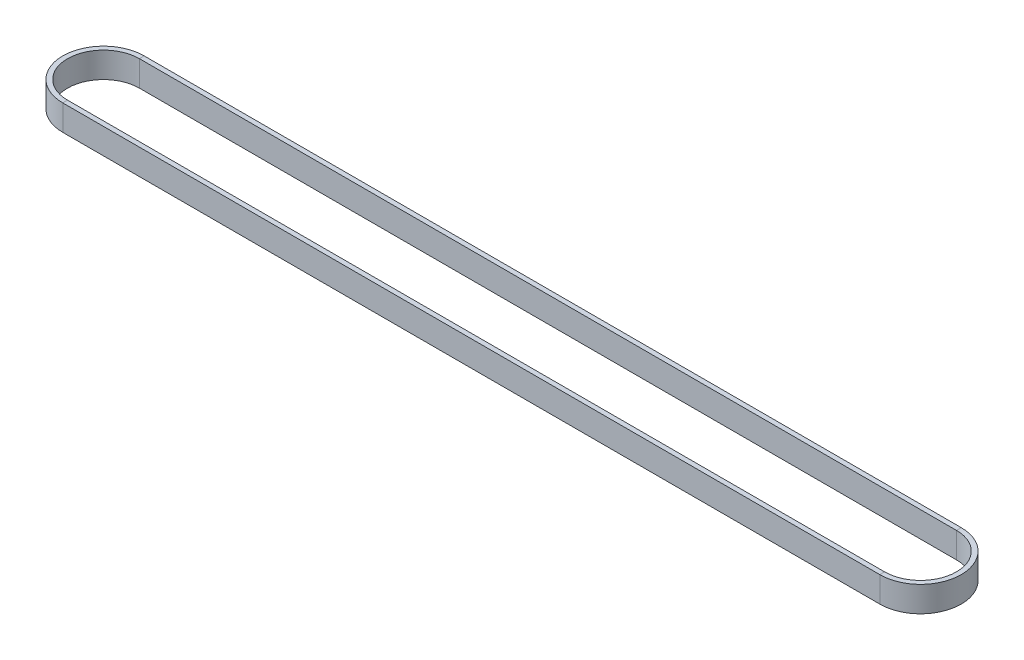
ISO-10303-21;
HEADER;
FILE_DESCRIPTION(('STEP AP214'),'2;1');
FILE_NAME('part.step','',(''),(''),'','','');
FILE_SCHEMA(('AUTOMOTIVE_DESIGN { 1 0 10303 214 1 1 1 1 }'));
ENDSEC;
DATA;
#1=APPLICATION_CONTEXT('core data for automotive mechanical design processes');
#2=APPLICATION_PROTOCOL_DEFINITION('international standard','automotive_design',2000,#1);
#3=PRODUCT_CONTEXT('',#1,'mechanical');
#4=PRODUCT('Part','Part','',(#3));
#5=PRODUCT_RELATED_PRODUCT_CATEGORY('part','',(#4));
#6=PRODUCT_DEFINITION_FORMATION('','',#4);
#7=PRODUCT_DEFINITION_CONTEXT('part definition',#1,'design');
#8=PRODUCT_DEFINITION('design','',#6,#7);
#9=PRODUCT_DEFINITION_SHAPE('','',#8);
#10=(LENGTH_UNIT() NAMED_UNIT(*) SI_UNIT(.MILLI.,.METRE.));
#11=(NAMED_UNIT(*) PLANE_ANGLE_UNIT() SI_UNIT($,.RADIAN.));
#12=(NAMED_UNIT(*) SI_UNIT($,.STERADIAN.) SOLID_ANGLE_UNIT());
#13=UNCERTAINTY_MEASURE_WITH_UNIT(LENGTH_MEASURE(1.E-05),#10,'distance_accuracy_value','');
#14=(GEOMETRIC_REPRESENTATION_CONTEXT(3) GLOBAL_UNCERTAINTY_ASSIGNED_CONTEXT((#13)) GLOBAL_UNIT_ASSIGNED_CONTEXT((#10,
#11,#12)) REPRESENTATION_CONTEXT('',''));
#15=CARTESIAN_POINT('',(0.,0.,0.));
#16=DIRECTION('',(0.,0.,1.));
#17=DIRECTION('',(1.,0.,0.));
#18=AXIS2_PLACEMENT_3D('',#15,#16,#17);
#19=CARTESIAN_POINT('',(325.005160504,-5.08,14.2875));
#20=DIRECTION('',(0.,0.,1.));
#21=DIRECTION('',(1.,0.,0.));
#22=AXIS2_PLACEMENT_3D('',#19,#20,#21);
#23=PLANE('',#22);
#24=DIRECTION('',(0.,1.,0.));
#25=VECTOR('',#24,1.);
#26=CARTESIAN_POINT('',(325.005160504,-5.08,14.2875));
#27=LINE('',#26,#25);
#28=CARTESIAN_POINT('',(325.005160504,-5.08,14.2875));
#29=VERTEX_POINT('',#28);
#30=CARTESIAN_POINT('',(325.005160504,5.08,14.2875));
#31=VERTEX_POINT('',#30);
#32=EDGE_CURVE('E173',#29,#31,#27,.T.);
#33=ORIENTED_EDGE('',*,*,#32,.F.);
#34=DIRECTION('',(-1.,0.,0.));
#35=VECTOR('',#34,1.);
#36=CARTESIAN_POINT('',(325.005160504,-5.08,14.2875));
#37=LINE('',#36,#35);
#38=CARTESIAN_POINT('',(0.,-5.08,14.2875));
#39=VERTEX_POINT('',#38);
#40=EDGE_CURVE('E172',#29,#39,#37,.T.);
#41=ORIENTED_EDGE('',*,*,#40,.T.);
#42=DIRECTION('',(0.,1.,0.));
#43=VECTOR('',#42,1.);
#44=CARTESIAN_POINT('',(0.,-5.08,14.2875));
#45=LINE('',#44,#43);
#46=CARTESIAN_POINT('',(0.,5.08,14.2875));
#47=VERTEX_POINT('',#46);
#48=EDGE_CURVE('E149',#39,#47,#45,.T.);
#49=ORIENTED_EDGE('',*,*,#48,.T.);
#50=DIRECTION('',(-1.,0.,0.));
#51=VECTOR('',#50,1.);
#52=CARTESIAN_POINT('',(325.005160504,5.08,14.2875));
#53=LINE('',#52,#51);
#54=EDGE_CURVE('E178',#31,#47,#53,.T.);
#55=ORIENTED_EDGE('',*,*,#54,.F.);
#56=EDGE_LOOP('',(#33,#41,#49,#55));
#57=FACE_BOUND('',#56,.T.);
#58=ADVANCED_FACE('F38',(#57),#23,.F.);
#59=CARTESIAN_POINT('',(0.,0.,0.));
#60=DIRECTION('',(0.,-1.,0.));
#61=DIRECTION('',(0.,0.,-1.));
#62=AXIS2_PLACEMENT_3D('',#59,#60,#61);
#63=CYLINDRICAL_SURFACE('',#62,14.2875);
#64=CARTESIAN_POINT('',(0.,5.08,0.));
#65=DIRECTION('',(0.,-1.,0.));
#66=DIRECTION('',(0.,0.,1.));
#67=AXIS2_PLACEMENT_3D('',#64,#65,#66);
#68=CIRCLE('',#67,14.2875);
#69=CARTESIAN_POINT('',(0.,5.08,-14.2875));
#70=VERTEX_POINT('',#69);
#71=EDGE_CURVE('E136',#47,#70,#68,.T.);
#72=ORIENTED_EDGE('',*,*,#71,.F.);
#73=ORIENTED_EDGE('',*,*,#48,.F.);
#74=CARTESIAN_POINT('',(0.,-5.08,0.));
#75=DIRECTION('',(0.,-1.,0.));
#76=DIRECTION('',(0.,0.,1.));
#77=AXIS2_PLACEMENT_3D('',#74,#75,#76);
#78=CIRCLE('',#77,14.2875);
#79=CARTESIAN_POINT('',(0.,-5.08,-14.2875));
#80=VERTEX_POINT('',#79);
#81=EDGE_CURVE('E152',#39,#80,#78,.T.);
#82=ORIENTED_EDGE('',*,*,#81,.T.);
#83=DIRECTION('',(0.,1.,0.));
#84=VECTOR('',#83,1.);
#85=CARTESIAN_POINT('',(0.,-5.08,-14.2875));
#86=LINE('',#85,#84);
#87=EDGE_CURVE('E169',#80,#70,#86,.T.);
#88=ORIENTED_EDGE('',*,*,#87,.T.);
#89=EDGE_LOOP('',(#72,#73,#82,#88));
#90=FACE_BOUND('',#89,.T.);
#91=ADVANCED_FACE('F151',(#90),#63,.F.);
#92=CARTESIAN_POINT('',(0.,5.08,14.2875));
#93=DIRECTION('',(0.,-1.,0.));
#94=DIRECTION('',(0.,0.,-1.));
#95=AXIS2_PLACEMENT_3D('',#92,#93,#94);
#96=PLANE('',#95);
#97=CARTESIAN_POINT('',(0.,5.08,0.));
#98=DIRECTION('',(0.,-1.,0.));
#99=DIRECTION('',(0.,0.,1.));
#100=AXIS2_PLACEMENT_3D('',#97,#98,#99);
#101=CIRCLE('',#100,16.1925);
#102=CARTESIAN_POINT('',(0.,5.08,16.1925));
#103=VERTEX_POINT('',#102);
#104=CARTESIAN_POINT('',(0.,5.08,-16.1925));
#105=VERTEX_POINT('',#104);
#106=EDGE_CURVE('E130',#103,#105,#101,.T.);
#107=ORIENTED_EDGE('',*,*,#106,.F.);
#108=DIRECTION('',(0.,0.,1.));
#109=VECTOR('',#108,1.);
#110=CARTESIAN_POINT('',(0.,5.08,14.2875));
#111=LINE('',#110,#109);
#112=EDGE_CURVE('E158',#47,#103,#111,.T.);
#113=ORIENTED_EDGE('',*,*,#112,.F.);
#114=ORIENTED_EDGE('',*,*,#71,.T.);
#115=DIRECTION('',(0.,0.,-1.));
#116=VECTOR('',#115,1.);
#117=CARTESIAN_POINT('',(0.,5.08,-14.2875));
#118=LINE('',#117,#116);
#119=EDGE_CURVE('E240',#70,#105,#118,.T.);
#120=ORIENTED_EDGE('',*,*,#119,.T.);
#121=EDGE_LOOP('',(#107,#113,#114,#120));
#122=FACE_BOUND('',#121,.T.);
#123=ADVANCED_FACE('F265',(#122),#96,.F.);
#124=CARTESIAN_POINT('',(0.,0.,0.));
#125=DIRECTION('',(0.,-1.,0.));
#126=DIRECTION('',(0.,0.,-1.));
#127=AXIS2_PLACEMENT_3D('',#124,#125,#126);
#128=CYLINDRICAL_SURFACE('',#127,16.1925);
#129=CARTESIAN_POINT('',(0.,-5.08,0.));
#130=DIRECTION('',(0.,-1.,0.));
#131=DIRECTION('',(0.,0.,1.));
#132=AXIS2_PLACEMENT_3D('',#129,#130,#131);
#133=CIRCLE('',#132,16.1925);
#134=CARTESIAN_POINT('',(0.,-5.08,16.1925));
#135=VERTEX_POINT('',#134);
#136=CARTESIAN_POINT('',(0.,-5.08,-16.1925));
#137=VERTEX_POINT('',#136);
#138=EDGE_CURVE('E192',#135,#137,#133,.T.);
#139=ORIENTED_EDGE('',*,*,#138,.F.);
#140=DIRECTION('',(0.,-1.,0.));
#141=VECTOR('',#140,1.);
#142=CARTESIAN_POINT('',(0.,-5.08,16.1925));
#143=LINE('',#142,#141);
#144=EDGE_CURVE('E182',#103,#135,#143,.T.);
#145=ORIENTED_EDGE('',*,*,#144,.F.);
#146=ORIENTED_EDGE('',*,*,#106,.T.);
#147=DIRECTION('',(0.,-1.,0.));
#148=VECTOR('',#147,1.);
#149=CARTESIAN_POINT('',(0.,-5.08,-16.1925));
#150=LINE('',#149,#148);
#151=EDGE_CURVE('E222',#105,#137,#150,.T.);
#152=ORIENTED_EDGE('',*,*,#151,.T.);
#153=EDGE_LOOP('',(#139,#145,#146,#152));
#154=FACE_BOUND('',#153,.T.);
#155=ADVANCED_FACE('F221',(#154),#128,.T.);
#156=CARTESIAN_POINT('',(0.,-5.08,14.2875));
#157=DIRECTION('',(0.,1.,0.));
#158=DIRECTION('',(0.,0.,1.));
#159=AXIS2_PLACEMENT_3D('',#156,#157,#158);
#160=PLANE('',#159);
#161=DIRECTION('',(0.,0.,1.));
#162=VECTOR('',#161,1.);
#163=CARTESIAN_POINT('',(0.,-5.08,-14.2875));
#164=LINE('',#163,#162);
#165=EDGE_CURVE('E166',#137,#80,#164,.T.);
#166=ORIENTED_EDGE('',*,*,#165,.T.);
#167=ORIENTED_EDGE('',*,*,#81,.F.);
#168=DIRECTION('',(0.,0.,-1.));
#169=VECTOR('',#168,1.);
#170=CARTESIAN_POINT('',(0.,-5.08,14.2875));
#171=LINE('',#170,#169);
#172=EDGE_CURVE('E165',#135,#39,#171,.T.);
#173=ORIENTED_EDGE('',*,*,#172,.F.);
#174=ORIENTED_EDGE('',*,*,#138,.T.);
#175=EDGE_LOOP('',(#166,#167,#173,#174));
#176=FACE_BOUND('',#175,.T.);
#177=ADVANCED_FACE('F163',(#176),#160,.F.);
#178=CARTESIAN_POINT('',(0.,-5.08,-14.2875));
#179=DIRECTION('',(0.,0.,-1.));
#180=DIRECTION('',(-1.,0.,0.));
#181=AXIS2_PLACEMENT_3D('',#178,#179,#180);
#182=PLANE('',#181);
#183=DIRECTION('',(1.,0.,0.));
#184=VECTOR('',#183,1.);
#185=CARTESIAN_POINT('',(0.,5.08,-14.2875));
#186=LINE('',#185,#184);
#187=CARTESIAN_POINT('',(325.005160504,5.08,-14.2875));
#188=VERTEX_POINT('',#187);
#189=EDGE_CURVE('E115',#70,#188,#186,.T.);
#190=ORIENTED_EDGE('',*,*,#189,.F.);
#191=ORIENTED_EDGE('',*,*,#87,.F.);
#192=DIRECTION('',(1.,0.,0.));
#193=VECTOR('',#192,1.);
#194=CARTESIAN_POINT('',(0.,-5.08,-14.2875));
#195=LINE('',#194,#193);
#196=CARTESIAN_POINT('',(325.005160504,-5.08,-14.2875));
#197=VERTEX_POINT('',#196);
#198=EDGE_CURVE('E191',#80,#197,#195,.T.);
#199=ORIENTED_EDGE('',*,*,#198,.T.);
#200=DIRECTION('',(0.,1.,0.));
#201=VECTOR('',#200,1.);
#202=CARTESIAN_POINT('',(325.005160504,-5.08,-14.2875));
#203=LINE('',#202,#201);
#204=EDGE_CURVE('E254',#197,#188,#203,.T.);
#205=ORIENTED_EDGE('',*,*,#204,.T.);
#206=EDGE_LOOP('',(#190,#191,#199,#205));
#207=FACE_BOUND('',#206,.T.);
#208=ADVANCED_FACE('F261',(#207),#182,.F.);
#209=CARTESIAN_POINT('',(0.,5.08,-14.2875));
#210=DIRECTION('',(0.,-1.,0.));
#211=DIRECTION('',(0.,0.,-1.));
#212=AXIS2_PLACEMENT_3D('',#209,#210,#211);
#213=PLANE('',#212);
#214=DIRECTION('',(1.,0.,0.));
#215=VECTOR('',#214,1.);
#216=CARTESIAN_POINT('',(0.,5.08,-16.1925));
#217=LINE('',#216,#215);
#218=CARTESIAN_POINT('',(325.005160504,5.08,-16.1925));
#219=VERTEX_POINT('',#218);
#220=EDGE_CURVE('E108',#105,#219,#217,.T.);
#221=ORIENTED_EDGE('',*,*,#220,.F.);
#222=ORIENTED_EDGE('',*,*,#119,.F.);
#223=ORIENTED_EDGE('',*,*,#189,.T.);
#224=DIRECTION('',(0.,0.,-1.));
#225=VECTOR('',#224,1.);
#226=CARTESIAN_POINT('',(325.005160504,5.08,-14.2875));
#227=LINE('',#226,#225);
#228=EDGE_CURVE('E236',#188,#219,#227,.T.);
#229=ORIENTED_EDGE('',*,*,#228,.T.);
#230=EDGE_LOOP('',(#221,#222,#223,#229));
#231=FACE_BOUND('',#230,.T.);
#232=ADVANCED_FACE('F264',(#231),#213,.F.);
#233=CARTESIAN_POINT('',(0.,-5.08,-16.1925));
#234=DIRECTION('',(0.,0.,1.));
#235=DIRECTION('',(1.,0.,0.));
#236=AXIS2_PLACEMENT_3D('',#233,#234,#235);
#237=PLANE('',#236);
#238=DIRECTION('',(1.,0.,0.));
#239=VECTOR('',#238,1.);
#240=CARTESIAN_POINT('',(0.,-5.08,-16.1925));
#241=LINE('',#240,#239);
#242=CARTESIAN_POINT('',(325.005160504,-5.08,-16.1925));
#243=VERTEX_POINT('',#242);
#244=EDGE_CURVE('E97',#137,#243,#241,.T.);
#245=ORIENTED_EDGE('',*,*,#244,.F.);
#246=ORIENTED_EDGE('',*,*,#151,.F.);
#247=ORIENTED_EDGE('',*,*,#220,.T.);
#248=DIRECTION('',(0.,-1.,0.));
#249=VECTOR('',#248,1.);
#250=CARTESIAN_POINT('',(325.005160504,-5.08,-16.1925));
#251=LINE('',#250,#249);
#252=EDGE_CURVE('E202',#219,#243,#251,.T.);
#253=ORIENTED_EDGE('',*,*,#252,.T.);
#254=EDGE_LOOP('',(#245,#246,#247,#253));
#255=FACE_BOUND('',#254,.T.);
#256=ADVANCED_FACE('F283',(#255),#237,.F.);
#257=CARTESIAN_POINT('',(0.,-5.08,-14.2875));
#258=DIRECTION('',(0.,1.,0.));
#259=DIRECTION('',(0.,0.,1.));
#260=AXIS2_PLACEMENT_3D('',#257,#258,#259);
#261=PLANE('',#260);
#262=DIRECTION('',(0.,0.,1.));
#263=VECTOR('',#262,1.);
#264=CARTESIAN_POINT('',(325.005160504,-5.08,-14.2875));
#265=LINE('',#264,#263);
#266=EDGE_CURVE('E193',#243,#197,#265,.T.);
#267=ORIENTED_EDGE('',*,*,#266,.T.);
#268=ORIENTED_EDGE('',*,*,#198,.F.);
#269=ORIENTED_EDGE('',*,*,#165,.F.);
#270=ORIENTED_EDGE('',*,*,#244,.T.);
#271=EDGE_LOOP('',(#267,#268,#269,#270));
#272=FACE_BOUND('',#271,.T.);
#273=ADVANCED_FACE('F275',(#272),#261,.F.);
#274=CARTESIAN_POINT('',(325.005160504,0.,0.));
#275=DIRECTION('',(0.,-1.,0.));
#276=DIRECTION('',(0.,0.,-1.));
#277=AXIS2_PLACEMENT_3D('',#274,#275,#276);
#278=CYLINDRICAL_SURFACE('',#277,14.2875);
#279=CARTESIAN_POINT('',(325.005160504,5.08,0.));
#280=DIRECTION('',(0.,-1.,0.));
#281=DIRECTION('',(0.,0.,-1.));
#282=AXIS2_PLACEMENT_3D('',#279,#280,#281);
#283=CIRCLE('',#282,14.2875);
#284=EDGE_CURVE('E233',#188,#31,#283,.T.);
#285=ORIENTED_EDGE('',*,*,#284,.F.);
#286=ORIENTED_EDGE('',*,*,#204,.F.);
#287=CARTESIAN_POINT('',(325.005160504,-5.08,0.));
#288=DIRECTION('',(0.,-1.,0.));
#289=DIRECTION('',(0.,0.,-1.));
#290=AXIS2_PLACEMENT_3D('',#287,#288,#289);
#291=CIRCLE('',#290,14.2875);
#292=EDGE_CURVE('E195',#197,#29,#291,.T.);
#293=ORIENTED_EDGE('',*,*,#292,.T.);
#294=ORIENTED_EDGE('',*,*,#32,.T.);
#295=EDGE_LOOP('',(#285,#286,#293,#294));
#296=FACE_BOUND('',#295,.T.);
#297=ADVANCED_FACE('F273',(#296),#278,.F.);
#298=CARTESIAN_POINT('',(325.005160504,5.08,-14.2875));
#299=DIRECTION('',(0.,-1.,0.));
#300=DIRECTION('',(0.,0.,-1.));
#301=AXIS2_PLACEMENT_3D('',#298,#299,#300);
#302=PLANE('',#301);
#303=CARTESIAN_POINT('',(325.005160504,5.08,0.));
#304=DIRECTION('',(0.,-1.,0.));
#305=DIRECTION('',(0.,0.,-1.));
#306=AXIS2_PLACEMENT_3D('',#303,#304,#305);
#307=CIRCLE('',#306,16.1925);
#308=CARTESIAN_POINT('',(325.005160504,5.08,16.1925));
#309=VERTEX_POINT('',#308);
#310=EDGE_CURVE('E69',#219,#309,#307,.T.);
#311=ORIENTED_EDGE('',*,*,#310,.F.);
#312=ORIENTED_EDGE('',*,*,#228,.F.);
#313=ORIENTED_EDGE('',*,*,#284,.T.);
#314=DIRECTION('',(0.,0.,1.));
#315=VECTOR('',#314,1.);
#316=CARTESIAN_POINT('',(325.005160504,5.08,14.2875));
#317=LINE('',#316,#315);
#318=EDGE_CURVE('E230',#31,#309,#317,.T.);
#319=ORIENTED_EDGE('',*,*,#318,.T.);
#320=EDGE_LOOP('',(#311,#312,#313,#319));
#321=FACE_BOUND('',#320,.T.);
#322=ADVANCED_FACE('F270',(#321),#302,.F.);
#323=CARTESIAN_POINT('',(325.005160504,0.,0.));
#324=DIRECTION('',(0.,-1.,0.));
#325=DIRECTION('',(0.,0.,-1.));
#326=AXIS2_PLACEMENT_3D('',#323,#324,#325);
#327=CYLINDRICAL_SURFACE('',#326,16.1925);
#328=CARTESIAN_POINT('',(325.005160504,-5.08,0.));
#329=DIRECTION('',(0.,-1.,0.));
#330=DIRECTION('',(0.,0.,-1.));
#331=AXIS2_PLACEMENT_3D('',#328,#329,#330);
#332=CIRCLE('',#331,16.1925);
#333=CARTESIAN_POINT('',(325.005160504,-5.08,16.1925));
#334=VERTEX_POINT('',#333);
#335=EDGE_CURVE('E59',#243,#334,#332,.T.);
#336=ORIENTED_EDGE('',*,*,#335,.F.);
#337=ORIENTED_EDGE('',*,*,#252,.F.);
#338=ORIENTED_EDGE('',*,*,#310,.T.);
#339=DIRECTION('',(0.,-1.,0.));
#340=VECTOR('',#339,1.);
#341=CARTESIAN_POINT('',(325.005160504,-5.08,16.1925));
#342=LINE('',#341,#340);
#343=EDGE_CURVE('E210',#309,#334,#342,.T.);
#344=ORIENTED_EDGE('',*,*,#343,.T.);
#345=EDGE_LOOP('',(#336,#337,#338,#344));
#346=FACE_BOUND('',#345,.T.);
#347=ADVANCED_FACE('F281',(#346),#327,.T.);
#348=CARTESIAN_POINT('',(325.005160504,-5.08,-14.2875));
#349=DIRECTION('',(0.,1.,0.));
#350=DIRECTION('',(0.,0.,1.));
#351=AXIS2_PLACEMENT_3D('',#348,#349,#350);
#352=PLANE('',#351);
#353=DIRECTION('',(0.,0.,-1.));
#354=VECTOR('',#353,1.);
#355=CARTESIAN_POINT('',(325.005160504,-5.08,14.2875));
#356=LINE('',#355,#354);
#357=EDGE_CURVE('E42',#334,#29,#356,.T.);
#358=ORIENTED_EDGE('',*,*,#357,.T.);
#359=ORIENTED_EDGE('',*,*,#292,.F.);
#360=ORIENTED_EDGE('',*,*,#266,.F.);
#361=ORIENTED_EDGE('',*,*,#335,.T.);
#362=EDGE_LOOP('',(#358,#359,#360,#361));
#363=FACE_BOUND('',#362,.T.);
#364=ADVANCED_FACE('F215',(#363),#352,.F.);
#365=CARTESIAN_POINT('',(325.005160504,5.08,14.2875));
#366=DIRECTION('',(0.,-1.,0.));
#367=DIRECTION('',(0.,0.,-1.));
#368=AXIS2_PLACEMENT_3D('',#365,#366,#367);
#369=PLANE('',#368);
#370=ORIENTED_EDGE('',*,*,#54,.T.);
#371=ORIENTED_EDGE('',*,*,#112,.T.);
#372=DIRECTION('',(-1.,0.,0.));
#373=VECTOR('',#372,1.);
#374=CARTESIAN_POINT('',(325.005160504,5.08,16.1925));
#375=LINE('',#374,#373);
#376=EDGE_CURVE('E48',#309,#103,#375,.T.);
#377=ORIENTED_EDGE('',*,*,#376,.F.);
#378=ORIENTED_EDGE('',*,*,#318,.F.);
#379=EDGE_LOOP('',(#370,#371,#377,#378));
#380=FACE_BOUND('',#379,.T.);
#381=ADVANCED_FACE('F267',(#380),#369,.F.);
#382=CARTESIAN_POINT('',(325.005160504,-5.08,16.1925));
#383=DIRECTION('',(0.,0.,-1.));
#384=DIRECTION('',(-1.,0.,0.));
#385=AXIS2_PLACEMENT_3D('',#382,#383,#384);
#386=PLANE('',#385);
#387=ORIENTED_EDGE('',*,*,#376,.T.);
#388=ORIENTED_EDGE('',*,*,#144,.T.);
#389=DIRECTION('',(-1.,0.,0.));
#390=VECTOR('',#389,1.);
#391=CARTESIAN_POINT('',(325.005160504,-5.08,16.1925));
#392=LINE('',#391,#390);
#393=EDGE_CURVE('E11',#334,#135,#392,.T.);
#394=ORIENTED_EDGE('',*,*,#393,.F.);
#395=ORIENTED_EDGE('',*,*,#343,.F.);
#396=EDGE_LOOP('',(#387,#388,#394,#395));
#397=FACE_BOUND('',#396,.T.);
#398=ADVANCED_FACE('F219',(#397),#386,.F.);
#399=CARTESIAN_POINT('',(325.005160504,-5.08,14.2875));
#400=DIRECTION('',(0.,1.,0.));
#401=DIRECTION('',(0.,0.,1.));
#402=AXIS2_PLACEMENT_3D('',#399,#400,#401);
#403=PLANE('',#402);
#404=ORIENTED_EDGE('',*,*,#393,.T.);
#405=ORIENTED_EDGE('',*,*,#172,.T.);
#406=ORIENTED_EDGE('',*,*,#40,.F.);
#407=ORIENTED_EDGE('',*,*,#357,.F.);
#408=EDGE_LOOP('',(#404,#405,#406,#407));
#409=FACE_BOUND('',#408,.T.);
#410=ADVANCED_FACE('F40',(#409),#403,.F.);
#411=CLOSED_SHELL('',(#58,#91,#123,#155,#177,#208,#232,#256,#273,#297,#322,#347,#364,#381,#398,#410));
#412=MANIFOLD_SOLID_BREP('B2',#411);
#413=ADVANCED_BREP_SHAPE_REPRESENTATION('',(#18,#412),#14);
#414=SHAPE_DEFINITION_REPRESENTATION(#9,#413);
ENDSEC;
END-ISO-10303-21;
